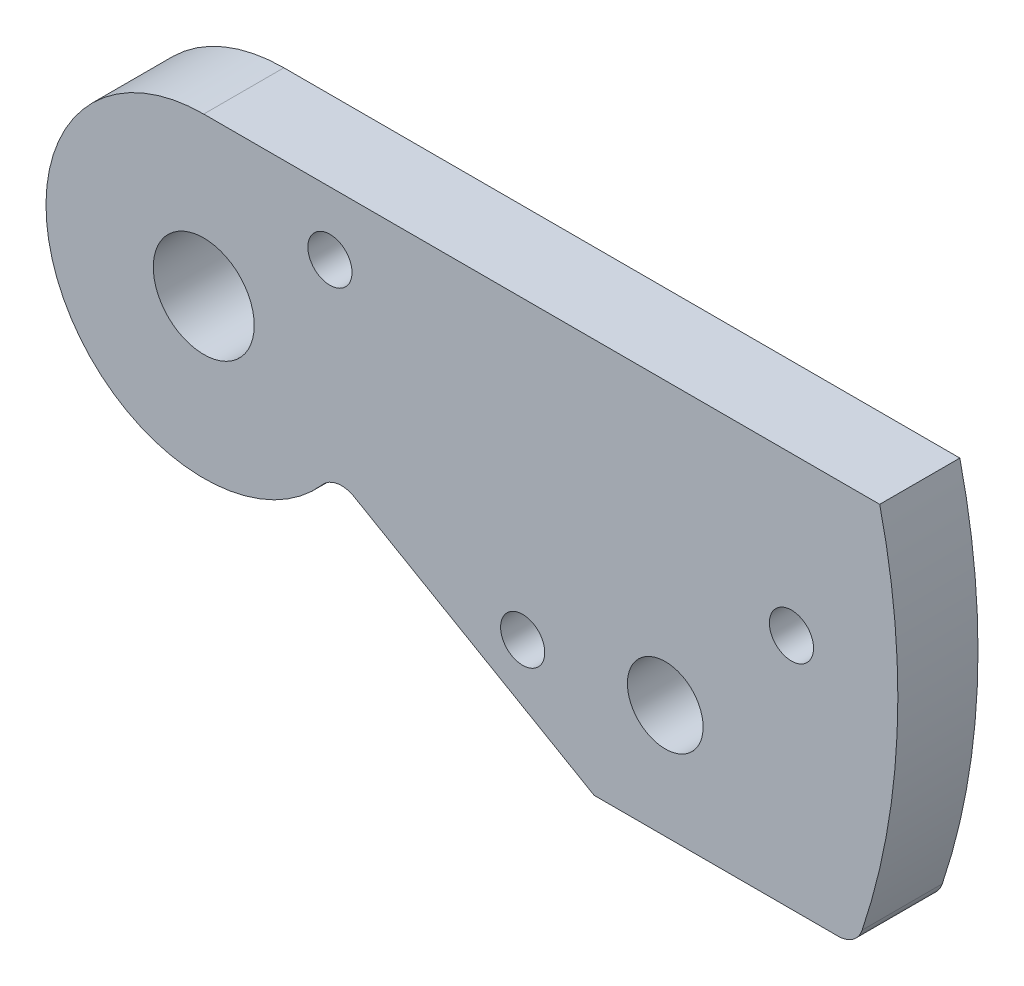
ISO-10303-21;
HEADER;
FILE_DESCRIPTION(('STEP AP214'),'2;1');
FILE_NAME('part.step','',(''),(''),'','','');
FILE_SCHEMA(('AUTOMOTIVE_DESIGN { 1 0 10303 214 1 1 1 1 }'));
ENDSEC;
DATA;
#1=APPLICATION_CONTEXT('core data for automotive mechanical design processes');
#2=APPLICATION_PROTOCOL_DEFINITION('international standard','automotive_design',2000,#1);
#3=PRODUCT_CONTEXT('',#1,'mechanical');
#4=PRODUCT('Part','Part','',(#3));
#5=PRODUCT_RELATED_PRODUCT_CATEGORY('part','',(#4));
#6=PRODUCT_DEFINITION_FORMATION('','',#4);
#7=PRODUCT_DEFINITION_CONTEXT('part definition',#1,'design');
#8=PRODUCT_DEFINITION('design','',#6,#7);
#9=PRODUCT_DEFINITION_SHAPE('','',#8);
#10=(LENGTH_UNIT() NAMED_UNIT(*) SI_UNIT(.MILLI.,.METRE.));
#11=(NAMED_UNIT(*) PLANE_ANGLE_UNIT() SI_UNIT($,.RADIAN.));
#12=(NAMED_UNIT(*) SI_UNIT($,.STERADIAN.) SOLID_ANGLE_UNIT());
#13=UNCERTAINTY_MEASURE_WITH_UNIT(LENGTH_MEASURE(1.E-05),#10,'distance_accuracy_value','');
#14=(GEOMETRIC_REPRESENTATION_CONTEXT(3) GLOBAL_UNCERTAINTY_ASSIGNED_CONTEXT((#13)) GLOBAL_UNIT_ASSIGNED_CONTEXT((#10,
#11,#12)) REPRESENTATION_CONTEXT('',''));
#15=CARTESIAN_POINT('',(0.,0.,0.));
#16=DIRECTION('',(0.,0.,1.));
#17=DIRECTION('',(1.,0.,0.));
#18=AXIS2_PLACEMENT_3D('',#15,#16,#17);
#19=CARTESIAN_POINT('',(0.,0.,6.35));
#20=DIRECTION('',(0.,0.,1.));
#21=DIRECTION('',(1.,0.,0.));
#22=AXIS2_PLACEMENT_3D('',#19,#20,#21);
#23=PLANE('',#22);
#24=CARTESIAN_POINT('',(387.1687,0.,6.35));
#25=DIRECTION('',(0.,0.,1.));
#26=DIRECTION('',(1.,0.,0.));
#27=AXIS2_PLACEMENT_3D('',#24,#25,#26);
#28=CIRCLE('',#27,1.74999999999998);
#29=CARTESIAN_POINT('',(388.9187,0.,6.35));
#30=VERTEX_POINT('',#29);
#31=EDGE_CURVE('E174',#30,#30,#28,.T.);
#32=ORIENTED_EDGE('',*,*,#31,.F.);
#33=EDGE_LOOP('',(#32));
#34=FACE_BOUND('',#33,.T.);
#35=CARTESIAN_POINT('',(365.870678247258,-10.9441410965979,6.35));
#36=DIRECTION('',(0.,0.,1.));
#37=DIRECTION('',(1.,0.,0.));
#38=AXIS2_PLACEMENT_3D('',#35,#36,#37);
#39=CIRCLE('',#38,1.74999999999998);
#40=CARTESIAN_POINT('',(367.620678247258,-10.9441410965979,6.35));
#41=VERTEX_POINT('',#40);
#42=EDGE_CURVE('E179',#41,#41,#39,.T.);
#43=ORIENTED_EDGE('',*,*,#42,.F.);
#44=EDGE_LOOP('',(#43));
#45=FACE_BOUND('',#44,.T.);
#46=CARTESIAN_POINT('',(350.6,7.5,6.35));
#47=DIRECTION('',(0.,0.,1.));
#48=DIRECTION('',(1.,0.,0.));
#49=AXIS2_PLACEMENT_3D('',#46,#47,#48);
#50=CIRCLE('',#49,1.74999999999998);
#51=CARTESIAN_POINT('',(352.35,7.5,6.35));
#52=VERTEX_POINT('',#51);
#53=EDGE_CURVE('E124',#52,#52,#50,.T.);
#54=ORIENTED_EDGE('',*,*,#53,.F.);
#55=EDGE_LOOP('',(#54));
#56=FACE_BOUND('',#55,.T.);
#57=DIRECTION('',(1.,0.,0.));
#58=VECTOR('',#57,1.);
#59=CARTESIAN_POINT('',(0.,12.5,6.35));
#60=LINE('',#59,#58);
#61=CARTESIAN_POINT('',(340.6,12.5,6.35));
#62=VERTEX_POINT('',#61);
#63=CARTESIAN_POINT('',(394.160713214071,12.5,6.35));
#64=VERTEX_POINT('',#63);
#65=EDGE_CURVE('E112',#62,#64,#60,.T.);
#66=ORIENTED_EDGE('',*,*,#65,.F.);
#67=CARTESIAN_POINT('',(340.6,0.,6.35));
#68=DIRECTION('',(0.,0.,1.));
#69=DIRECTION('',(1.,0.,0.));
#70=AXIS2_PLACEMENT_3D('',#67,#68,#69);
#71=CIRCLE('',#70,12.5);
#72=CARTESIAN_POINT('',(350.014410667645,-8.22306948656868,6.35));
#73=VERTEX_POINT('',#72);
#74=EDGE_CURVE('E98',#62,#73,#71,.T.);
#75=ORIENTED_EDGE('',*,*,#74,.T.);
#76=CARTESIAN_POINT('',(351.520716374468,-9.53876060441968,6.35));
#77=DIRECTION('',(0.,0.,1.));
#78=DIRECTION('',(1.,0.,0.));
#79=AXIS2_PLACEMENT_3D('',#76,#77,#78);
#80=CIRCLE('',#79,2.);
#81=CARTESIAN_POINT('',(352.520787173343,-7.80675067452985,6.35));
#82=VERTEX_POINT('',#81);
#83=EDGE_CURVE('E170',#73,#82,#80,.F.);
#84=ORIENTED_EDGE('',*,*,#83,.T.);
#85=DIRECTION('',(0.866004964944908,-0.500035399437648,0.));
#86=VECTOR('',#85,1.);
#87=CARTESIAN_POINT('',(84.7620945261553,146.798396236211,6.35));
#88=LINE('',#87,#86);
#89=CARTESIAN_POINT('',(371.53231921384,-18.7840999999999,6.35));
#90=VERTEX_POINT('',#89);
#91=EDGE_CURVE('E107',#82,#90,#88,.T.);
#92=ORIENTED_EDGE('',*,*,#91,.T.);
#93=DIRECTION('',(1.,0.,0.));
#94=VECTOR('',#93,1.);
#95=CARTESIAN_POINT('',(0.,-18.7840999999999,6.35));
#96=LINE('',#95,#94);
#97=CARTESIAN_POINT('',(390.87219894922,-18.7841,6.35));
#98=VERTEX_POINT('',#97);
#99=EDGE_CURVE('E131',#90,#98,#96,.T.);
#100=ORIENTED_EDGE('',*,*,#99,.T.);
#101=CARTESIAN_POINT('',(390.87219894922,-16.7841,6.35));
#102=DIRECTION('',(0.,0.,1.));
#103=DIRECTION('',(1.,0.,0.));
#104=AXIS2_PLACEMENT_3D('',#101,#102,#103);
#105=CIRCLE('',#104,2.);
#106=CARTESIAN_POINT('',(392.769263060512,-17.4174622641509,6.35));
#107=VERTEX_POINT('',#106);
#108=EDGE_CURVE('E162',#98,#107,#105,.T.);
#109=ORIENTED_EDGE('',*,*,#108,.T.);
#110=CARTESIAN_POINT('',(340.6,0.,6.35));
#111=DIRECTION('',(0.,0.,1.));
#112=DIRECTION('',(1.,0.,0.));
#113=AXIS2_PLACEMENT_3D('',#110,#111,#112);
#114=CIRCLE('',#113,55.);
#115=EDGE_CURVE('E120',#107,#64,#114,.T.);
#116=ORIENTED_EDGE('',*,*,#115,.T.);
#117=EDGE_LOOP('',(#66,#75,#84,#92,#100,#109,#116));
#118=FACE_BOUND('',#117,.T.);
#119=CARTESIAN_POINT('',(340.6,0.,6.35));
#120=DIRECTION('',(0.,0.,1.));
#121=DIRECTION('',(1.,0.,0.));
#122=AXIS2_PLACEMENT_3D('',#119,#120,#121);
#123=CIRCLE('',#122,3.99999999999999);
#124=CARTESIAN_POINT('',(344.6,0.,6.35));
#125=VERTEX_POINT('',#124);
#126=EDGE_CURVE('E141',#125,#125,#123,.T.);
#127=ORIENTED_EDGE('',*,*,#126,.F.);
#128=EDGE_LOOP('',(#127));
#129=FACE_BOUND('',#128,.T.);
#130=CARTESIAN_POINT('',(377.1687,-9.7841,6.35));
#131=DIRECTION('',(0.,0.,1.));
#132=DIRECTION('',(1.,0.,0.));
#133=AXIS2_PLACEMENT_3D('',#130,#131,#132);
#134=CIRCLE('',#133,2.99999999999999);
#135=CARTESIAN_POINT('',(380.1687,-9.7841,6.35));
#136=VERTEX_POINT('',#135);
#137=EDGE_CURVE('E138',#136,#136,#134,.T.);
#138=ORIENTED_EDGE('',*,*,#137,.F.);
#139=EDGE_LOOP('',(#138));
#140=FACE_BOUND('',#139,.T.);
#141=ADVANCED_FACE('F37',(#34,#45,#56,#118,#129,#140),#23,.T.);
#142=CARTESIAN_POINT('',(0.,0.,0.));
#143=DIRECTION('',(0.,0.,1.));
#144=DIRECTION('',(1.,0.,0.));
#145=AXIS2_PLACEMENT_3D('',#142,#143,#144);
#146=PLANE('',#145);
#147=CARTESIAN_POINT('',(387.1687,0.,0.));
#148=DIRECTION('',(0.,0.,1.));
#149=DIRECTION('',(1.,0.,0.));
#150=AXIS2_PLACEMENT_3D('',#147,#148,#149);
#151=CIRCLE('',#150,1.74999999999998);
#152=CARTESIAN_POINT('',(388.9187,0.,0.));
#153=VERTEX_POINT('',#152);
#154=EDGE_CURVE('E41',#153,#153,#151,.T.);
#155=ORIENTED_EDGE('',*,*,#154,.T.);
#156=EDGE_LOOP('',(#155));
#157=FACE_BOUND('',#156,.T.);
#158=CARTESIAN_POINT('',(365.870678247258,-10.9441410965979,0.));
#159=DIRECTION('',(0.,0.,1.));
#160=DIRECTION('',(1.,0.,0.));
#161=AXIS2_PLACEMENT_3D('',#158,#159,#160);
#162=CIRCLE('',#161,1.74999999999998);
#163=CARTESIAN_POINT('',(367.620678247258,-10.9441410965979,0.));
#164=VERTEX_POINT('',#163);
#165=EDGE_CURVE('E172',#164,#164,#162,.T.);
#166=ORIENTED_EDGE('',*,*,#165,.T.);
#167=EDGE_LOOP('',(#166));
#168=FACE_BOUND('',#167,.T.);
#169=CARTESIAN_POINT('',(350.6,7.5,0.));
#170=DIRECTION('',(0.,0.,1.));
#171=DIRECTION('',(1.,0.,0.));
#172=AXIS2_PLACEMENT_3D('',#169,#170,#171);
#173=CIRCLE('',#172,1.74999999999998);
#174=CARTESIAN_POINT('',(352.35,7.5,0.));
#175=VERTEX_POINT('',#174);
#176=EDGE_CURVE('E121',#175,#175,#173,.T.);
#177=ORIENTED_EDGE('',*,*,#176,.T.);
#178=EDGE_LOOP('',(#177));
#179=FACE_BOUND('',#178,.T.);
#180=CARTESIAN_POINT('',(377.1687,-9.7841,0.));
#181=DIRECTION('',(0.,0.,1.));
#182=DIRECTION('',(1.,0.,0.));
#183=AXIS2_PLACEMENT_3D('',#180,#181,#182);
#184=CIRCLE('',#183,2.99999999999999);
#185=CARTESIAN_POINT('',(380.1687,-9.7841,0.));
#186=VERTEX_POINT('',#185);
#187=EDGE_CURVE('E137',#186,#186,#184,.T.);
#188=ORIENTED_EDGE('',*,*,#187,.T.);
#189=EDGE_LOOP('',(#188));
#190=FACE_BOUND('',#189,.T.);
#191=CARTESIAN_POINT('',(340.6,0.,0.));
#192=DIRECTION('',(0.,0.,1.));
#193=DIRECTION('',(1.,0.,0.));
#194=AXIS2_PLACEMENT_3D('',#191,#192,#193);
#195=CIRCLE('',#194,3.99999999999999);
#196=CARTESIAN_POINT('',(344.6,0.,0.));
#197=VERTEX_POINT('',#196);
#198=EDGE_CURVE('E142',#197,#197,#195,.T.);
#199=ORIENTED_EDGE('',*,*,#198,.T.);
#200=EDGE_LOOP('',(#199));
#201=FACE_BOUND('',#200,.T.);
#202=CARTESIAN_POINT('',(340.6,0.,0.));
#203=DIRECTION('',(0.,0.,1.));
#204=DIRECTION('',(1.,0.,0.));
#205=AXIS2_PLACEMENT_3D('',#202,#203,#204);
#206=CIRCLE('',#205,12.5);
#207=CARTESIAN_POINT('',(340.6,12.5,0.));
#208=VERTEX_POINT('',#207);
#209=CARTESIAN_POINT('',(350.014410667645,-8.22306948656868,0.));
#210=VERTEX_POINT('',#209);
#211=EDGE_CURVE('E157',#208,#210,#206,.T.);
#212=ORIENTED_EDGE('',*,*,#211,.F.);
#213=DIRECTION('',(1.,0.,0.));
#214=VECTOR('',#213,1.);
#215=CARTESIAN_POINT('',(0.,12.5,0.));
#216=LINE('',#215,#214);
#217=CARTESIAN_POINT('',(394.160713214071,12.5,0.));
#218=VERTEX_POINT('',#217);
#219=EDGE_CURVE('E115',#208,#218,#216,.T.);
#220=ORIENTED_EDGE('',*,*,#219,.T.);
#221=CARTESIAN_POINT('',(340.6,0.,0.));
#222=DIRECTION('',(0.,0.,1.));
#223=DIRECTION('',(1.,0.,0.));
#224=AXIS2_PLACEMENT_3D('',#221,#222,#223);
#225=CIRCLE('',#224,55.);
#226=CARTESIAN_POINT('',(392.769263060512,-17.4174622641509,0.));
#227=VERTEX_POINT('',#226);
#228=EDGE_CURVE('E145',#227,#218,#225,.T.);
#229=ORIENTED_EDGE('',*,*,#228,.F.);
#230=CARTESIAN_POINT('',(390.87219894922,-16.7841,0.));
#231=DIRECTION('',(0.,0.,1.));
#232=DIRECTION('',(1.,0.,0.));
#233=AXIS2_PLACEMENT_3D('',#230,#231,#232);
#234=CIRCLE('',#233,2.);
#235=CARTESIAN_POINT('',(390.87219894922,-18.7841,0.));
#236=VERTEX_POINT('',#235);
#237=EDGE_CURVE('E166',#227,#236,#234,.F.);
#238=ORIENTED_EDGE('',*,*,#237,.T.);
#239=DIRECTION('',(1.,0.,0.));
#240=VECTOR('',#239,1.);
#241=CARTESIAN_POINT('',(0.,-18.7840999999999,0.));
#242=LINE('',#241,#240);
#243=CARTESIAN_POINT('',(371.53231921384,-18.7840999999999,0.));
#244=VERTEX_POINT('',#243);
#245=EDGE_CURVE('E152',#244,#236,#242,.T.);
#246=ORIENTED_EDGE('',*,*,#245,.F.);
#247=DIRECTION('',(0.866004964944908,-0.500035399437648,0.));
#248=VECTOR('',#247,1.);
#249=CARTESIAN_POINT('',(84.7620945261553,146.798396236211,0.));
#250=LINE('',#249,#248);
#251=CARTESIAN_POINT('',(352.520787173343,-7.80675067452982,0.));
#252=VERTEX_POINT('',#251);
#253=EDGE_CURVE('E155',#252,#244,#250,.T.);
#254=ORIENTED_EDGE('',*,*,#253,.F.);
#255=CARTESIAN_POINT('',(351.520716374468,-9.53876060441968,0.));
#256=DIRECTION('',(0.,0.,1.));
#257=DIRECTION('',(1.,0.,0.));
#258=AXIS2_PLACEMENT_3D('',#255,#256,#257);
#259=CIRCLE('',#258,2.);
#260=EDGE_CURVE('E46',#252,#210,#259,.T.);
#261=ORIENTED_EDGE('',*,*,#260,.T.);
#262=EDGE_LOOP('',(#212,#220,#229,#238,#246,#254,#261));
#263=FACE_BOUND('',#262,.T.);
#264=ADVANCED_FACE('F191',(#157,#168,#179,#190,#201,#263),#146,.F.);
#265=CARTESIAN_POINT('',(377.1687,-9.7841,6.35));
#266=DIRECTION('',(0.,0.,-1.));
#267=DIRECTION('',(-1.,0.,0.));
#268=AXIS2_PLACEMENT_3D('',#265,#266,#267);
#269=CYLINDRICAL_SURFACE('',#268,2.99999999999999);
#270=ORIENTED_EDGE('',*,*,#137,.T.);
#271=EDGE_LOOP('',(#270));
#272=FACE_BOUND('',#271,.T.);
#273=ORIENTED_EDGE('',*,*,#187,.F.);
#274=EDGE_LOOP('',(#273));
#275=FACE_BOUND('',#274,.T.);
#276=ADVANCED_FACE('F205',(#272,#275),#269,.F.);
#277=CARTESIAN_POINT('',(340.6,0.,6.35));
#278=DIRECTION('',(0.,0.,-1.));
#279=DIRECTION('',(-1.,0.,0.));
#280=AXIS2_PLACEMENT_3D('',#277,#278,#279);
#281=CYLINDRICAL_SURFACE('',#280,3.99999999999999);
#282=ORIENTED_EDGE('',*,*,#126,.T.);
#283=EDGE_LOOP('',(#282));
#284=FACE_BOUND('',#283,.T.);
#285=ORIENTED_EDGE('',*,*,#198,.F.);
#286=EDGE_LOOP('',(#285));
#287=FACE_BOUND('',#286,.T.);
#288=ADVANCED_FACE('F235',(#284,#287),#281,.F.);
#289=CARTESIAN_POINT('',(340.6,0.,-0.65));
#290=DIRECTION('',(0.,0.,1.));
#291=DIRECTION('',(1.,0.,0.));
#292=AXIS2_PLACEMENT_3D('',#289,#290,#291);
#293=CYLINDRICAL_SURFACE('',#292,12.5);
#294=ORIENTED_EDGE('',*,*,#74,.F.);
#295=DIRECTION('',(0.,0.,1.));
#296=VECTOR('',#295,1.);
#297=CARTESIAN_POINT('',(340.6,12.5,-3.65));
#298=LINE('',#297,#296);
#299=EDGE_CURVE('E101',#208,#62,#298,.T.);
#300=ORIENTED_EDGE('',*,*,#299,.F.);
#301=ORIENTED_EDGE('',*,*,#211,.T.);
#302=DIRECTION('',(0.,0.,1.));
#303=VECTOR('',#302,1.);
#304=CARTESIAN_POINT('',(350.014410667645,-8.22306948656868,-0.65));
#305=LINE('',#304,#303);
#306=EDGE_CURVE('E103',#210,#73,#305,.T.);
#307=ORIENTED_EDGE('',*,*,#306,.T.);
#308=EDGE_LOOP('',(#294,#300,#301,#307));
#309=FACE_BOUND('',#308,.T.);
#310=ADVANCED_FACE('F100',(#309),#293,.T.);
#311=CARTESIAN_POINT('',(84.7620945261553,146.798396236211,-0.65));
#312=DIRECTION('',(-0.500035399437648,-0.866004964944908,0.));
#313=DIRECTION('',(0.866004964944908,-0.500035399437648,0.));
#314=AXIS2_PLACEMENT_3D('',#311,#312,#313);
#315=PLANE('',#314);
#316=ORIENTED_EDGE('',*,*,#91,.F.);
#317=DIRECTION('',(0.,0.,-1.));
#318=VECTOR('',#317,1.);
#319=CARTESIAN_POINT('',(352.520787173343,-7.80675067452983,0.));
#320=LINE('',#319,#318);
#321=EDGE_CURVE('E61',#82,#252,#320,.T.);
#322=ORIENTED_EDGE('',*,*,#321,.T.);
#323=ORIENTED_EDGE('',*,*,#253,.T.);
#324=DIRECTION('',(0.,0.,1.));
#325=VECTOR('',#324,1.);
#326=CARTESIAN_POINT('',(371.53231921384,-18.7840999999999,-0.65));
#327=LINE('',#326,#325);
#328=EDGE_CURVE('E106',#244,#90,#327,.T.);
#329=ORIENTED_EDGE('',*,*,#328,.T.);
#330=EDGE_LOOP('',(#316,#322,#323,#329));
#331=FACE_BOUND('',#330,.T.);
#332=ADVANCED_FACE('F213',(#331),#315,.T.);
#333=CARTESIAN_POINT('',(0.,-18.7840999999999,-0.65));
#334=DIRECTION('',(0.,-1.,0.));
#335=DIRECTION('',(1.,0.,0.));
#336=AXIS2_PLACEMENT_3D('',#333,#334,#335);
#337=PLANE('',#336);
#338=ORIENTED_EDGE('',*,*,#245,.T.);
#339=DIRECTION('',(0.,0.,1.));
#340=VECTOR('',#339,1.);
#341=CARTESIAN_POINT('',(390.87219894922,-18.7841,-0.65));
#342=LINE('',#341,#340);
#343=EDGE_CURVE('E159',#236,#98,#342,.T.);
#344=ORIENTED_EDGE('',*,*,#343,.T.);
#345=ORIENTED_EDGE('',*,*,#99,.F.);
#346=ORIENTED_EDGE('',*,*,#328,.F.);
#347=EDGE_LOOP('',(#338,#344,#345,#346));
#348=FACE_BOUND('',#347,.T.);
#349=ADVANCED_FACE('F218',(#348),#337,.T.);
#350=CARTESIAN_POINT('',(340.6,0.,-0.65));
#351=DIRECTION('',(0.,0.,1.));
#352=DIRECTION('',(1.,0.,0.));
#353=AXIS2_PLACEMENT_3D('',#350,#351,#352);
#354=CYLINDRICAL_SURFACE('',#353,55.);
#355=DIRECTION('',(0.,0.,1.));
#356=VECTOR('',#355,1.);
#357=CARTESIAN_POINT('',(394.160713214071,12.5,-0.65));
#358=LINE('',#357,#356);
#359=EDGE_CURVE('E11',#64,#218,#358,.F.);
#360=ORIENTED_EDGE('',*,*,#359,.F.);
#361=ORIENTED_EDGE('',*,*,#115,.F.);
#362=DIRECTION('',(0.,0.,1.));
#363=VECTOR('',#362,1.);
#364=CARTESIAN_POINT('',(392.769263060512,-17.4174622641509,-0.65));
#365=LINE('',#364,#363);
#366=EDGE_CURVE('E164',#107,#227,#365,.F.);
#367=ORIENTED_EDGE('',*,*,#366,.T.);
#368=ORIENTED_EDGE('',*,*,#228,.T.);
#369=EDGE_LOOP('',(#360,#361,#367,#368));
#370=FACE_BOUND('',#369,.T.);
#371=ADVANCED_FACE('F223',(#370),#354,.T.);
#372=CARTESIAN_POINT('',(390.87219894922,-16.7841,-0.65));
#373=DIRECTION('',(0.,0.,1.));
#374=DIRECTION('',(1.,0.,0.));
#375=AXIS2_PLACEMENT_3D('',#372,#373,#374);
#376=CYLINDRICAL_SURFACE('',#375,2.);
#377=ORIENTED_EDGE('',*,*,#237,.F.);
#378=ORIENTED_EDGE('',*,*,#366,.F.);
#379=ORIENTED_EDGE('',*,*,#108,.F.);
#380=ORIENTED_EDGE('',*,*,#343,.F.);
#381=EDGE_LOOP('',(#377,#378,#379,#380));
#382=FACE_BOUND('',#381,.T.);
#383=ADVANCED_FACE('F225',(#382),#376,.T.);
#384=CARTESIAN_POINT('',(351.520716374468,-9.53876060441968,-0.65));
#385=DIRECTION('',(0.,0.,1.));
#386=DIRECTION('',(1.,0.,0.));
#387=AXIS2_PLACEMENT_3D('',#384,#385,#386);
#388=CYLINDRICAL_SURFACE('',#387,2.);
#389=ORIENTED_EDGE('',*,*,#260,.F.);
#390=ORIENTED_EDGE('',*,*,#321,.F.);
#391=ORIENTED_EDGE('',*,*,#83,.F.);
#392=ORIENTED_EDGE('',*,*,#306,.F.);
#393=EDGE_LOOP('',(#389,#390,#391,#392));
#394=FACE_BOUND('',#393,.T.);
#395=ADVANCED_FACE('F39',(#394),#388,.F.);
#396=CARTESIAN_POINT('',(0.,12.5,-3.65));
#397=DIRECTION('',(0.,-1.,0.));
#398=DIRECTION('',(0.,0.,-1.));
#399=AXIS2_PLACEMENT_3D('',#396,#397,#398);
#400=PLANE('',#399);
#401=ORIENTED_EDGE('',*,*,#299,.T.);
#402=ORIENTED_EDGE('',*,*,#65,.T.);
#403=ORIENTED_EDGE('',*,*,#359,.T.);
#404=ORIENTED_EDGE('',*,*,#219,.F.);
#405=EDGE_LOOP('',(#401,#402,#403,#404));
#406=FACE_BOUND('',#405,.T.);
#407=ADVANCED_FACE('F111',(#406),#400,.F.);
#408=CARTESIAN_POINT('',(350.6,7.5,-3.65));
#409=DIRECTION('',(0.,0.,1.));
#410=DIRECTION('',(1.,0.,0.));
#411=AXIS2_PLACEMENT_3D('',#408,#409,#410);
#412=CYLINDRICAL_SURFACE('',#411,1.74999999999998);
#413=ORIENTED_EDGE('',*,*,#53,.T.);
#414=EDGE_LOOP('',(#413));
#415=FACE_BOUND('',#414,.T.);
#416=ORIENTED_EDGE('',*,*,#176,.F.);
#417=EDGE_LOOP('',(#416));
#418=FACE_BOUND('',#417,.T.);
#419=ADVANCED_FACE('F197',(#415,#418),#412,.F.);
#420=CARTESIAN_POINT('',(365.870678247258,-10.9441410965979,-3.65));
#421=DIRECTION('',(0.,0.,1.));
#422=DIRECTION('',(1.,0.,0.));
#423=AXIS2_PLACEMENT_3D('',#420,#421,#422);
#424=CYLINDRICAL_SURFACE('',#423,1.74999999999998);
#425=ORIENTED_EDGE('',*,*,#42,.T.);
#426=EDGE_LOOP('',(#425));
#427=FACE_BOUND('',#426,.T.);
#428=ORIENTED_EDGE('',*,*,#165,.F.);
#429=EDGE_LOOP('',(#428));
#430=FACE_BOUND('',#429,.T.);
#431=ADVANCED_FACE('F186',(#427,#430),#424,.F.);
#432=CARTESIAN_POINT('',(387.1687,0.,-3.65));
#433=DIRECTION('',(0.,0.,1.));
#434=DIRECTION('',(1.,0.,0.));
#435=AXIS2_PLACEMENT_3D('',#432,#433,#434);
#436=CYLINDRICAL_SURFACE('',#435,1.74999999999998);
#437=ORIENTED_EDGE('',*,*,#31,.T.);
#438=EDGE_LOOP('',(#437));
#439=FACE_BOUND('',#438,.T.);
#440=ORIENTED_EDGE('',*,*,#154,.F.);
#441=EDGE_LOOP('',(#440));
#442=FACE_BOUND('',#441,.T.);
#443=ADVANCED_FACE('F250',(#439,#442),#436,.F.);
#444=CLOSED_SHELL('',(#141,#264,#276,#288,#310,#332,#349,#371,#383,#395,#407,#419,#431,#443));
#445=MANIFOLD_SOLID_BREP('B2',#444);
#446=ADVANCED_BREP_SHAPE_REPRESENTATION('',(#18,#445),#14);
#447=SHAPE_DEFINITION_REPRESENTATION(#9,#446);
ENDSEC;
END-ISO-10303-21;
